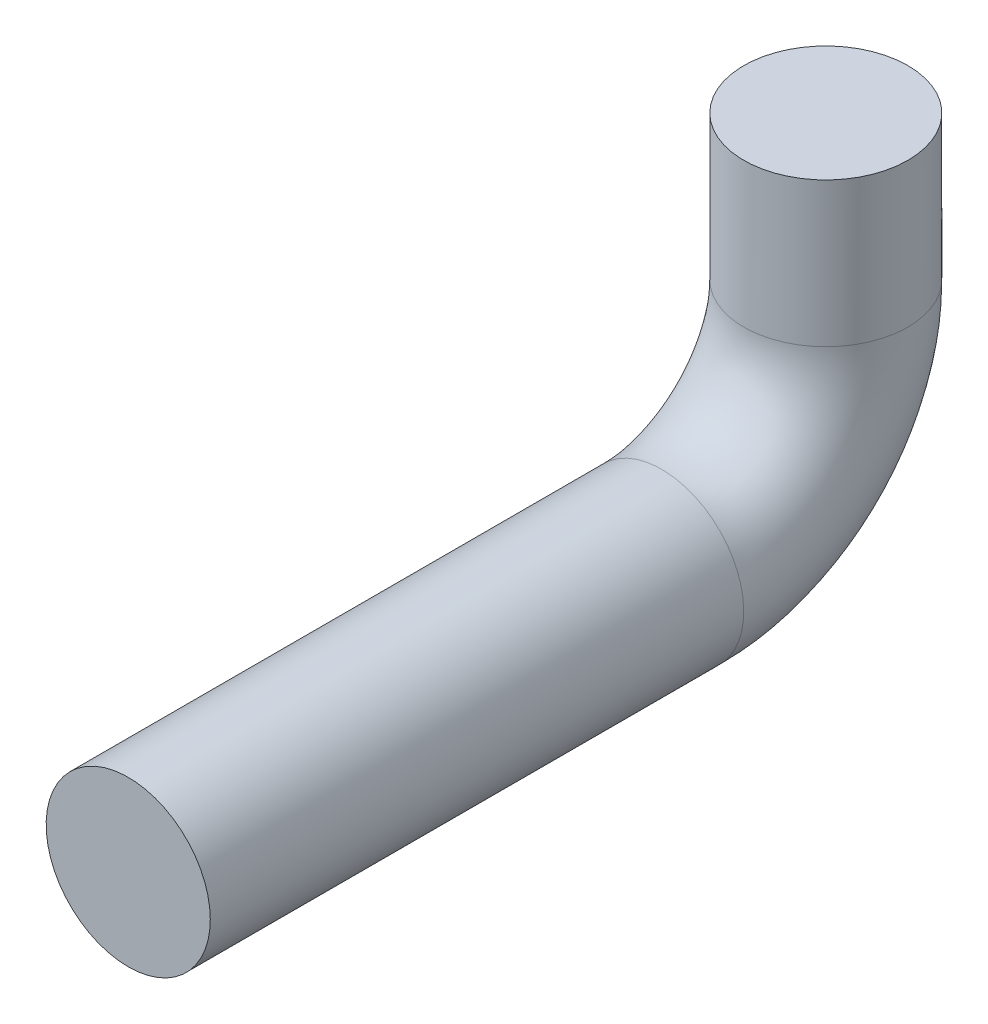
ISO-10303-21;
HEADER;
FILE_DESCRIPTION(('STEP AP214'),'2;1');
FILE_NAME('part.step','',(''),(''),'','','');
FILE_SCHEMA(('AUTOMOTIVE_DESIGN { 1 0 10303 214 1 1 1 1 }'));
ENDSEC;
DATA;
#1=APPLICATION_CONTEXT('core data for automotive mechanical design processes');
#2=APPLICATION_PROTOCOL_DEFINITION('international standard','automotive_design',2000,#1);
#3=PRODUCT_CONTEXT('',#1,'mechanical');
#4=PRODUCT('Part','Part','',(#3));
#5=PRODUCT_RELATED_PRODUCT_CATEGORY('part','',(#4));
#6=PRODUCT_DEFINITION_FORMATION('','',#4);
#7=PRODUCT_DEFINITION_CONTEXT('part definition',#1,'design');
#8=PRODUCT_DEFINITION('design','',#6,#7);
#9=PRODUCT_DEFINITION_SHAPE('','',#8);
#10=(LENGTH_UNIT() NAMED_UNIT(*) SI_UNIT(.MILLI.,.METRE.));
#11=(NAMED_UNIT(*) PLANE_ANGLE_UNIT() SI_UNIT($,.RADIAN.));
#12=(NAMED_UNIT(*) SI_UNIT($,.STERADIAN.) SOLID_ANGLE_UNIT());
#13=UNCERTAINTY_MEASURE_WITH_UNIT(LENGTH_MEASURE(1.E-05),#10,'distance_accuracy_value','');
#14=(GEOMETRIC_REPRESENTATION_CONTEXT(3) GLOBAL_UNCERTAINTY_ASSIGNED_CONTEXT((#13)) GLOBAL_UNIT_ASSIGNED_CONTEXT((#10,
#11,#12)) REPRESENTATION_CONTEXT('',''));
#15=CARTESIAN_POINT('',(0.,0.,0.));
#16=DIRECTION('',(0.,0.,1.));
#17=DIRECTION('',(1.,0.,0.));
#18=AXIS2_PLACEMENT_3D('',#15,#16,#17);
#19=CARTESIAN_POINT('',(0.,0.,0.));
#20=DIRECTION('',(0.,-1.,0.));
#21=DIRECTION('',(1.,0.,0.));
#22=AXIS2_PLACEMENT_3D('',#19,#20,#21);
#23=PLANE('',#22);
#24=CARTESIAN_POINT('',(0.,0.,0.));
#25=DIRECTION('',(0.,-1.,0.));
#26=DIRECTION('',(1.,0.,0.));
#27=AXIS2_PLACEMENT_3D('',#24,#25,#26);
#28=CIRCLE('',#27,12.7);
#29=CARTESIAN_POINT('',(12.7,0.,0.));
#30=VERTEX_POINT('',#29);
#31=EDGE_CURVE('E54',#30,#30,#28,.T.);
#32=ORIENTED_EDGE('',*,*,#31,.F.);
#33=EDGE_LOOP('',(#32));
#34=FACE_BOUND('',#33,.T.);
#35=ADVANCED_FACE('F37',(#34),#23,.F.);
#36=CARTESIAN_POINT('',(0.,-47.752,107.95));
#37=DIRECTION('',(0.,0.,1.));
#38=DIRECTION('',(1.,0.,0.));
#39=AXIS2_PLACEMENT_3D('',#36,#37,#38);
#40=PLANE('',#39);
#41=CARTESIAN_POINT('',(0.,-47.752,107.95));
#42=DIRECTION('',(0.,0.,1.));
#43=DIRECTION('',(1.,0.,0.));
#44=AXIS2_PLACEMENT_3D('',#41,#42,#43);
#45=CIRCLE('',#44,12.7);
#46=CARTESIAN_POINT('',(12.7,-47.752,107.95));
#47=VERTEX_POINT('',#46);
#48=EDGE_CURVE('E10',#47,#47,#45,.T.);
#49=ORIENTED_EDGE('',*,*,#48,.T.);
#50=EDGE_LOOP('',(#49));
#51=FACE_BOUND('',#50,.T.);
#52=ADVANCED_FACE('F64',(#51),#40,.T.);
#53=CARTESIAN_POINT('',(0.,0.,0.));
#54=DIRECTION('',(0.,-1.,0.));
#55=DIRECTION('',(0.,0.,-1.));
#56=AXIS2_PLACEMENT_3D('',#53,#54,#55);
#57=CYLINDRICAL_SURFACE('',#56,12.7);
#58=CARTESIAN_POINT('',(0.,-22.3519999999998,0.));
#59=DIRECTION('',(0.,-1.,0.));
#60=DIRECTION('',(1.,0.,0.));
#61=AXIS2_PLACEMENT_3D('',#58,#59,#60);
#62=CIRCLE('',#61,12.7);
#63=CARTESIAN_POINT('',(0.,-22.3519999999997,-12.7));
#64=VERTEX_POINT('',#63);
#65=EDGE_CURVE('E49',#64,#64,#62,.T.);
#66=ORIENTED_EDGE('',*,*,#65,.F.);
#67=EDGE_LOOP('',(#66));
#68=FACE_BOUND('',#67,.T.);
#69=ORIENTED_EDGE('',*,*,#31,.T.);
#70=EDGE_LOOP('',(#69));
#71=FACE_BOUND('',#70,.T.);
#72=ADVANCED_FACE('F61',(#68,#71),#57,.T.);
#73=CARTESIAN_POINT('',(0.,-22.352,25.4));
#74=DIRECTION('',(-1.,0.,0.));
#75=DIRECTION('',(0.,0.,1.));
#76=AXIS2_PLACEMENT_3D('',#73,#74,#75);
#77=TOROIDAL_SURFACE('',#76,25.4,12.7);
#78=CARTESIAN_POINT('',(0.,-47.7520000000008,25.3999999999998));
#79=DIRECTION('',(0.,0.,1.));
#80=DIRECTION('',(1.,0.,0.));
#81=AXIS2_PLACEMENT_3D('',#78,#79,#80);
#82=CIRCLE('',#81,12.7);
#83=CARTESIAN_POINT('',(0.,-60.452,25.3999999999997));
#84=VERTEX_POINT('',#83);
#85=EDGE_CURVE('E44',#84,#84,#82,.T.);
#86=CARTESIAN_POINT('',(0.,-22.352,25.4));
#87=DIRECTION('',(-1.,0.,0.));
#88=DIRECTION('',(0.,0.,1.));
#89=AXIS2_PLACEMENT_3D('',#86,#87,#88);
#90=CIRCLE('',#89,38.1);
#91=EDGE_CURVE('',#64,#84,#90,.T.);
#92=ORIENTED_EDGE('',*,*,#65,.T.);
#93=ORIENTED_EDGE('',*,*,#85,.F.);
#94=ORIENTED_EDGE('',*,*,#91,.T.);
#95=ORIENTED_EDGE('',*,*,#91,.F.);
#96=EDGE_LOOP('',(#92,#94,#93,#95));
#97=FACE_BOUND('',#96,.T.);
#98=ADVANCED_FACE('F70',(#97),#77,.T.);
#99=CARTESIAN_POINT('',(0.,-47.752,25.4000000000002));
#100=DIRECTION('',(0.,0.,1.));
#101=DIRECTION('',(0.,-1.,0.));
#102=AXIS2_PLACEMENT_3D('',#99,#100,#101);
#103=CYLINDRICAL_SURFACE('',#102,12.7);
#104=ORIENTED_EDGE('',*,*,#48,.F.);
#105=EDGE_LOOP('',(#104));
#106=FACE_BOUND('',#105,.T.);
#107=ORIENTED_EDGE('',*,*,#85,.T.);
#108=EDGE_LOOP('',(#107));
#109=FACE_BOUND('',#108,.T.);
#110=ADVANCED_FACE('F68',(#106,#109),#103,.T.);
#111=CLOSED_SHELL('',(#35,#52,#72,#98,#110));
#112=MANIFOLD_SOLID_BREP('B2',#111);
#113=ADVANCED_BREP_SHAPE_REPRESENTATION('',(#18,#112),#14);
#114=SHAPE_DEFINITION_REPRESENTATION(#9,#113);
ENDSEC;
END-ISO-10303-21;
